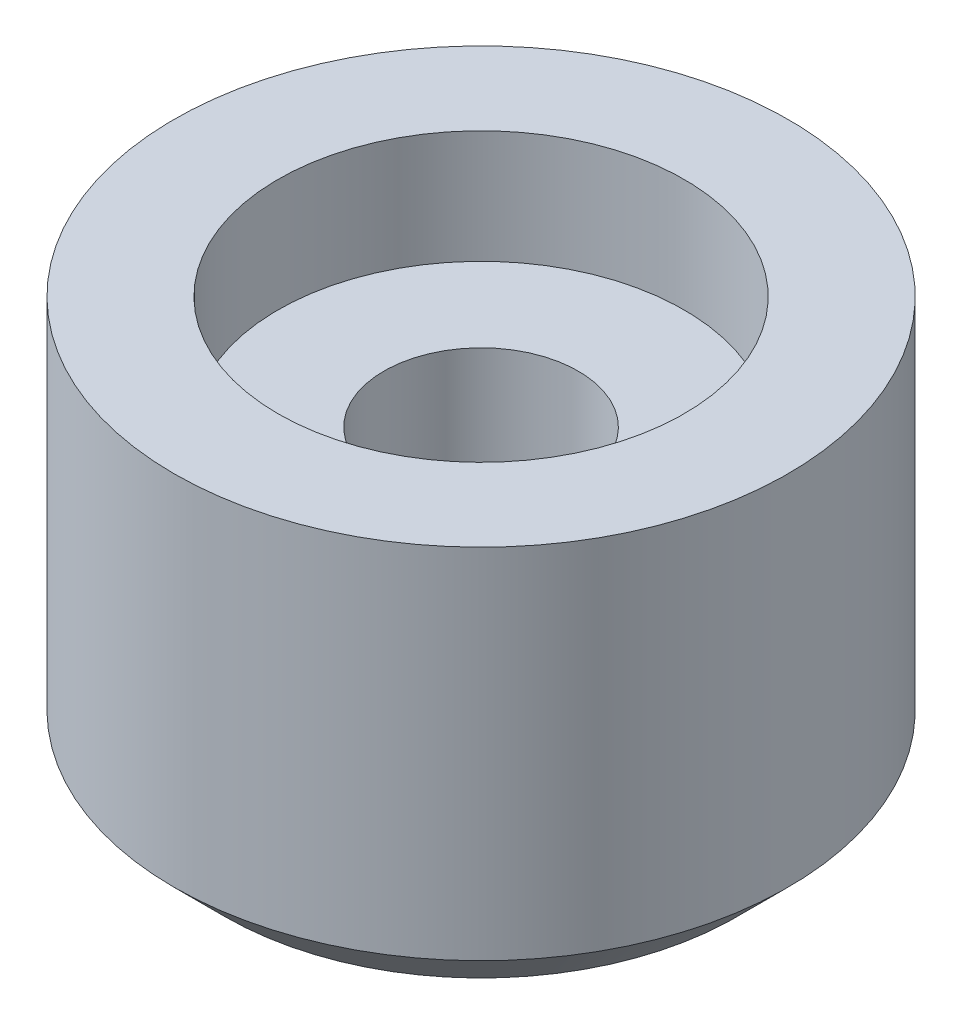
ISO-10303-21;
HEADER;
FILE_DESCRIPTION(('STEP AP214'),'2;1');
FILE_NAME('part.step','',(''),(''),'','','');
FILE_SCHEMA(('AUTOMOTIVE_DESIGN { 1 0 10303 214 1 1 1 1 }'));
ENDSEC;
DATA;
#1=APPLICATION_CONTEXT('core data for automotive mechanical design processes');
#2=APPLICATION_PROTOCOL_DEFINITION('international standard','automotive_design',2000,#1);
#3=PRODUCT_CONTEXT('',#1,'mechanical');
#4=PRODUCT('Part','Part','',(#3));
#5=PRODUCT_RELATED_PRODUCT_CATEGORY('part','',(#4));
#6=PRODUCT_DEFINITION_FORMATION('','',#4);
#7=PRODUCT_DEFINITION_CONTEXT('part definition',#1,'design');
#8=PRODUCT_DEFINITION('design','',#6,#7);
#9=PRODUCT_DEFINITION_SHAPE('','',#8);
#10=(LENGTH_UNIT() NAMED_UNIT(*) SI_UNIT(.MILLI.,.METRE.));
#11=(NAMED_UNIT(*) PLANE_ANGLE_UNIT() SI_UNIT($,.RADIAN.));
#12=(NAMED_UNIT(*) SI_UNIT($,.STERADIAN.) SOLID_ANGLE_UNIT());
#13=UNCERTAINTY_MEASURE_WITH_UNIT(LENGTH_MEASURE(1.E-05),#10,'distance_accuracy_value','');
#14=(GEOMETRIC_REPRESENTATION_CONTEXT(3) GLOBAL_UNCERTAINTY_ASSIGNED_CONTEXT((#13)) GLOBAL_UNIT_ASSIGNED_CONTEXT((#10,
#11,#12)) REPRESENTATION_CONTEXT('',''));
#15=CARTESIAN_POINT('',(0.,0.,0.));
#16=DIRECTION('',(0.,0.,1.));
#17=DIRECTION('',(1.,0.,0.));
#18=AXIS2_PLACEMENT_3D('',#15,#16,#17);
#19=CARTESIAN_POINT('',(0.,8.,0.));
#20=DIRECTION('',(0.,-1.,0.));
#21=DIRECTION('',(0.,0.,-1.));
#22=AXIS2_PLACEMENT_3D('',#19,#20,#21);
#23=CYLINDRICAL_SURFACE('',#22,6.);
#24=CARTESIAN_POINT('',(0.,1.,0.));
#25=DIRECTION('',(0.,1.,0.));
#26=DIRECTION('',(0.,0.,1.));
#27=AXIS2_PLACEMENT_3D('',#24,#25,#26);
#28=CIRCLE('',#27,6.);
#29=CARTESIAN_POINT('',(0.,1.,6.));
#30=VERTEX_POINT('',#29);
#31=EDGE_CURVE('E38',#30,#30,#28,.T.);
#32=ORIENTED_EDGE('',*,*,#31,.T.);
#33=EDGE_LOOP('',(#32));
#34=FACE_BOUND('',#33,.T.);
#35=CARTESIAN_POINT('',(0.,8.,0.));
#36=DIRECTION('',(0.,1.,0.));
#37=DIRECTION('',(0.,0.,1.));
#38=AXIS2_PLACEMENT_3D('',#35,#36,#37);
#39=CIRCLE('',#38,6.);
#40=CARTESIAN_POINT('',(0.,8.,6.));
#41=VERTEX_POINT('',#40);
#42=EDGE_CURVE('E42',#41,#41,#39,.T.);
#43=ORIENTED_EDGE('',*,*,#42,.F.);
#44=EDGE_LOOP('',(#43));
#45=FACE_BOUND('',#44,.T.);
#46=ADVANCED_FACE('F31',(#34,#45),#23,.T.);
#47=CARTESIAN_POINT('',(0.,8.,0.));
#48=DIRECTION('',(0.,1.,0.));
#49=DIRECTION('',(0.,0.,1.));
#50=AXIS2_PLACEMENT_3D('',#47,#48,#49);
#51=PLANE('',#50);
#52=CARTESIAN_POINT('',(0.,8.,0.));
#53=DIRECTION('',(0.,1.,0.));
#54=DIRECTION('',(0.,0.,1.));
#55=AXIS2_PLACEMENT_3D('',#52,#53,#54);
#56=CIRCLE('',#55,3.96875);
#57=CARTESIAN_POINT('',(0.,8.,3.96875));
#58=VERTEX_POINT('',#57);
#59=EDGE_CURVE('E57',#58,#58,#56,.T.);
#60=ORIENTED_EDGE('',*,*,#59,.F.);
#61=EDGE_LOOP('',(#60));
#62=FACE_BOUND('',#61,.T.);
#63=ORIENTED_EDGE('',*,*,#42,.T.);
#64=EDGE_LOOP('',(#63));
#65=FACE_BOUND('',#64,.T.);
#66=ADVANCED_FACE('F63',(#62,#65),#51,.T.);
#67=CARTESIAN_POINT('',(0.,0.,0.));
#68=DIRECTION('',(0.,1.,0.));
#69=DIRECTION('',(0.,0.,1.));
#70=AXIS2_PLACEMENT_3D('',#67,#68,#69);
#71=PLANE('',#70);
#72=CARTESIAN_POINT('',(0.,0.,0.));
#73=DIRECTION('',(0.,1.,0.));
#74=DIRECTION('',(0.,0.,1.));
#75=AXIS2_PLACEMENT_3D('',#72,#73,#74);
#76=CIRCLE('',#75,5.);
#77=CARTESIAN_POINT('',(0.,0.,5.));
#78=VERTEX_POINT('',#77);
#79=EDGE_CURVE('E10',#78,#78,#76,.F.);
#80=ORIENTED_EDGE('',*,*,#79,.T.);
#81=EDGE_LOOP('',(#80));
#82=FACE_BOUND('',#81,.T.);
#83=CARTESIAN_POINT('',(0.,0.,0.));
#84=DIRECTION('',(0.,1.,0.));
#85=DIRECTION('',(0.,0.,1.));
#86=AXIS2_PLACEMENT_3D('',#83,#84,#85);
#87=CIRCLE('',#86,1.89865);
#88=CARTESIAN_POINT('',(0.,0.,1.89865));
#89=VERTEX_POINT('',#88);
#90=EDGE_CURVE('E46',#89,#89,#87,.T.);
#91=ORIENTED_EDGE('',*,*,#90,.T.);
#92=EDGE_LOOP('',(#91));
#93=FACE_BOUND('',#92,.T.);
#94=ADVANCED_FACE('F66',(#82,#93),#71,.F.);
#95=CARTESIAN_POINT('',(0.,8.,0.));
#96=DIRECTION('',(0.,1.,0.));
#97=DIRECTION('',(0.,0.,1.));
#98=AXIS2_PLACEMENT_3D('',#95,#96,#97);
#99=CYLINDRICAL_SURFACE('',#98,1.89865);
#100=ORIENTED_EDGE('',*,*,#90,.F.);
#101=EDGE_LOOP('',(#100));
#102=FACE_BOUND('',#101,.T.);
#103=CARTESIAN_POINT('',(0.,5.7902,0.));
#104=DIRECTION('',(0.,1.,0.));
#105=DIRECTION('',(0.,0.,1.));
#106=AXIS2_PLACEMENT_3D('',#103,#104,#105);
#107=CIRCLE('',#106,1.89865);
#108=CARTESIAN_POINT('',(0.,5.7902,1.89865));
#109=VERTEX_POINT('',#108);
#110=EDGE_CURVE('E51',#109,#109,#107,.T.);
#111=ORIENTED_EDGE('',*,*,#110,.T.);
#112=EDGE_LOOP('',(#111));
#113=FACE_BOUND('',#112,.T.);
#114=ADVANCED_FACE('F75',(#102,#113),#99,.F.);
#115=CARTESIAN_POINT('',(1.89865,5.7902,0.));
#116=DIRECTION('',(0.,-1.,0.));
#117=DIRECTION('',(0.,0.,-1.));
#118=AXIS2_PLACEMENT_3D('',#115,#116,#117);
#119=PLANE('',#118);
#120=ORIENTED_EDGE('',*,*,#110,.F.);
#121=EDGE_LOOP('',(#120));
#122=FACE_BOUND('',#121,.T.);
#123=CARTESIAN_POINT('',(0.,5.7902,0.));
#124=DIRECTION('',(0.,1.,0.));
#125=DIRECTION('',(0.,0.,1.));
#126=AXIS2_PLACEMENT_3D('',#123,#124,#125);
#127=CIRCLE('',#126,3.96875);
#128=CARTESIAN_POINT('',(0.,5.7902,3.96875));
#129=VERTEX_POINT('',#128);
#130=EDGE_CURVE('E54',#129,#129,#127,.T.);
#131=ORIENTED_EDGE('',*,*,#130,.T.);
#132=EDGE_LOOP('',(#131));
#133=FACE_BOUND('',#132,.T.);
#134=ADVANCED_FACE('F79',(#122,#133),#119,.F.);
#135=CARTESIAN_POINT('',(0.,8.,0.));
#136=DIRECTION('',(0.,1.,0.));
#137=DIRECTION('',(0.,0.,1.));
#138=AXIS2_PLACEMENT_3D('',#135,#136,#137);
#139=CYLINDRICAL_SURFACE('',#138,3.96875);
#140=ORIENTED_EDGE('',*,*,#130,.F.);
#141=EDGE_LOOP('',(#140));
#142=FACE_BOUND('',#141,.T.);
#143=ORIENTED_EDGE('',*,*,#59,.T.);
#144=EDGE_LOOP('',(#143));
#145=FACE_BOUND('',#144,.T.);
#146=ADVANCED_FACE('F61',(#142,#145),#139,.F.);
#147=CARTESIAN_POINT('',(0.,1.,0.));
#148=DIRECTION('',(0.,1.,0.));
#149=DIRECTION('',(0.,0.,1.));
#150=AXIS2_PLACEMENT_3D('',#147,#148,#149);
#151=CONICAL_SURFACE('',#150,6.,0.785398163397449);
#152=ORIENTED_EDGE('',*,*,#79,.F.);
#153=EDGE_LOOP('',(#152));
#154=FACE_BOUND('',#153,.T.);
#155=ORIENTED_EDGE('',*,*,#31,.F.);
#156=EDGE_LOOP('',(#155));
#157=FACE_BOUND('',#156,.T.);
#158=ADVANCED_FACE('F33',(#154,#157),#151,.T.);
#159=CLOSED_SHELL('',(#46,#66,#94,#114,#134,#146,#158));
#160=MANIFOLD_SOLID_BREP('B2',#159);
#161=ADVANCED_BREP_SHAPE_REPRESENTATION('',(#18,#160),#14);
#162=SHAPE_DEFINITION_REPRESENTATION(#9,#161);
ENDSEC;
END-ISO-10303-21;
